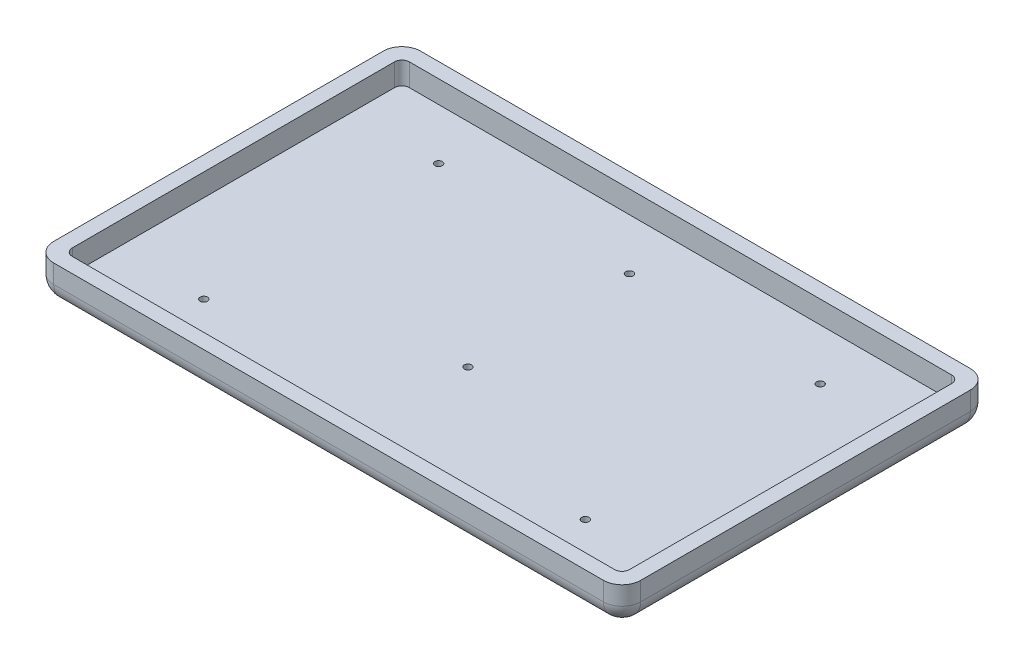
ISO-10303-21;
HEADER;
FILE_DESCRIPTION(('STEP AP214'),'2;1');
FILE_NAME('part.step','',(''),(''),'','','');
FILE_SCHEMA(('AUTOMOTIVE_DESIGN { 1 0 10303 214 1 1 1 1 }'));
ENDSEC;
DATA;
#1=APPLICATION_CONTEXT('core data for automotive mechanical design processes');
#2=APPLICATION_PROTOCOL_DEFINITION('international standard','automotive_design',2000,#1);
#3=PRODUCT_CONTEXT('',#1,'mechanical');
#4=PRODUCT('Part','Part','',(#3));
#5=PRODUCT_RELATED_PRODUCT_CATEGORY('part','',(#4));
#6=PRODUCT_DEFINITION_FORMATION('','',#4);
#7=PRODUCT_DEFINITION_CONTEXT('part definition',#1,'design');
#8=PRODUCT_DEFINITION('design','',#6,#7);
#9=PRODUCT_DEFINITION_SHAPE('','',#8);
#10=(LENGTH_UNIT() NAMED_UNIT(*) SI_UNIT(.MILLI.,.METRE.));
#11=(NAMED_UNIT(*) PLANE_ANGLE_UNIT() SI_UNIT($,.RADIAN.));
#12=(NAMED_UNIT(*) SI_UNIT($,.STERADIAN.) SOLID_ANGLE_UNIT());
#13=UNCERTAINTY_MEASURE_WITH_UNIT(LENGTH_MEASURE(1.E-05),#10,'distance_accuracy_value','');
#14=(GEOMETRIC_REPRESENTATION_CONTEXT(3) GLOBAL_UNCERTAINTY_ASSIGNED_CONTEXT((#13)) GLOBAL_UNIT_ASSIGNED_CONTEXT((#10,
#11,#12)) REPRESENTATION_CONTEXT('',''));
#15=CARTESIAN_POINT('',(0.,0.,0.));
#16=DIRECTION('',(0.,0.,1.));
#17=DIRECTION('',(1.,0.,0.));
#18=AXIS2_PLACEMENT_3D('',#15,#16,#17);
#19=CARTESIAN_POINT('',(-100.,12.7,-62.5));
#20=DIRECTION('',(1.,0.,0.));
#21=DIRECTION('',(0.,0.,-1.));
#22=AXIS2_PLACEMENT_3D('',#19,#20,#21);
#23=PLANE('',#22);
#24=DIRECTION('',(0.,-1.,0.));
#25=VECTOR('',#24,1.);
#26=CARTESIAN_POINT('',(-100.,12.7,-56.15));
#27=LINE('',#26,#25);
#28=CARTESIAN_POINT('',(-100.,12.7,-56.15));
#29=VERTEX_POINT('',#28);
#30=CARTESIAN_POINT('',(-100.,6.35,-56.15));
#31=VERTEX_POINT('',#30);
#32=EDGE_CURVE('E276',#29,#31,#27,.T.);
#33=ORIENTED_EDGE('',*,*,#32,.T.);
#34=DIRECTION('',(0.,0.,1.));
#35=VECTOR('',#34,1.);
#36=CARTESIAN_POINT('',(-100.,6.35,-62.5));
#37=LINE('',#36,#35);
#38=CARTESIAN_POINT('',(-100.,6.35,56.15));
#39=VERTEX_POINT('',#38);
#40=EDGE_CURVE('E322',#31,#39,#37,.T.);
#41=ORIENTED_EDGE('',*,*,#40,.T.);
#42=DIRECTION('',(0.,-1.,0.));
#43=VECTOR('',#42,1.);
#44=CARTESIAN_POINT('',(-100.,12.7,56.15));
#45=LINE('',#44,#43);
#46=CARTESIAN_POINT('',(-100.,12.7,56.15));
#47=VERTEX_POINT('',#46);
#48=EDGE_CURVE('E280',#39,#47,#45,.F.);
#49=ORIENTED_EDGE('',*,*,#48,.T.);
#50=DIRECTION('',(0.,0.,1.));
#51=VECTOR('',#50,1.);
#52=CARTESIAN_POINT('',(-100.,12.7,-62.5));
#53=LINE('',#52,#51);
#54=EDGE_CURVE('E213',#29,#47,#53,.T.);
#55=ORIENTED_EDGE('',*,*,#54,.F.);
#56=EDGE_LOOP('',(#33,#41,#49,#55));
#57=FACE_BOUND('',#56,.T.);
#58=ADVANCED_FACE('F45',(#57),#23,.F.);
#59=CARTESIAN_POINT('',(-100.,12.7,62.5));
#60=DIRECTION('',(0.,0.,-1.));
#61=DIRECTION('',(-1.,0.,0.));
#62=AXIS2_PLACEMENT_3D('',#59,#60,#61);
#63=PLANE('',#62);
#64=DIRECTION('',(0.,-1.,0.));
#65=VECTOR('',#64,1.);
#66=CARTESIAN_POINT('',(-93.65,12.7,62.5));
#67=LINE('',#66,#65);
#68=CARTESIAN_POINT('',(-93.65,12.7,62.5));
#69=VERTEX_POINT('',#68);
#70=CARTESIAN_POINT('',(-93.65,6.35,62.5));
#71=VERTEX_POINT('',#70);
#72=EDGE_CURVE('E272',#69,#71,#67,.T.);
#73=ORIENTED_EDGE('',*,*,#72,.T.);
#74=DIRECTION('',(1.,0.,0.));
#75=VECTOR('',#74,1.);
#76=CARTESIAN_POINT('',(-100.,6.35,62.5));
#77=LINE('',#76,#75);
#78=CARTESIAN_POINT('',(93.65,6.35,62.5));
#79=VERTEX_POINT('',#78);
#80=EDGE_CURVE('E335',#71,#79,#77,.T.);
#81=ORIENTED_EDGE('',*,*,#80,.T.);
#82=DIRECTION('',(0.,-1.,0.));
#83=VECTOR('',#82,1.);
#84=CARTESIAN_POINT('',(93.65,12.7,62.5));
#85=LINE('',#84,#83);
#86=CARTESIAN_POINT('',(93.65,12.7,62.5));
#87=VERTEX_POINT('',#86);
#88=EDGE_CURVE('E269',#79,#87,#85,.F.);
#89=ORIENTED_EDGE('',*,*,#88,.T.);
#90=DIRECTION('',(1.,0.,0.));
#91=VECTOR('',#90,1.);
#92=CARTESIAN_POINT('',(-100.,12.7,62.5));
#93=LINE('',#92,#91);
#94=EDGE_CURVE('E217',#69,#87,#93,.T.);
#95=ORIENTED_EDGE('',*,*,#94,.F.);
#96=EDGE_LOOP('',(#73,#81,#89,#95));
#97=FACE_BOUND('',#96,.T.);
#98=ADVANCED_FACE('F487',(#97),#63,.F.);
#99=CARTESIAN_POINT('',(100.,12.7,-62.5));
#100=DIRECTION('',(-1.,0.,0.));
#101=DIRECTION('',(0.,0.,1.));
#102=AXIS2_PLACEMENT_3D('',#99,#100,#101);
#103=PLANE('',#102);
#104=DIRECTION('',(0.,-1.,0.));
#105=VECTOR('',#104,1.);
#106=CARTESIAN_POINT('',(100.,12.7,56.15));
#107=LINE('',#106,#105);
#108=CARTESIAN_POINT('',(100.,12.7,56.15));
#109=VERTEX_POINT('',#108);
#110=CARTESIAN_POINT('',(100.,6.35,56.15));
#111=VERTEX_POINT('',#110);
#112=EDGE_CURVE('E302',#109,#111,#107,.T.);
#113=ORIENTED_EDGE('',*,*,#112,.T.);
#114=DIRECTION('',(0.,0.,-1.));
#115=VECTOR('',#114,1.);
#116=CARTESIAN_POINT('',(100.,6.35,-62.5));
#117=LINE('',#116,#115);
#118=CARTESIAN_POINT('',(100.,6.35,-56.15));
#119=VERTEX_POINT('',#118);
#120=EDGE_CURVE('E55',#111,#119,#117,.T.);
#121=ORIENTED_EDGE('',*,*,#120,.T.);
#122=DIRECTION('',(0.,-1.,0.));
#123=VECTOR('',#122,1.);
#124=CARTESIAN_POINT('',(100.,12.7,-56.15));
#125=LINE('',#124,#123);
#126=CARTESIAN_POINT('',(100.,12.7,-56.15));
#127=VERTEX_POINT('',#126);
#128=EDGE_CURVE('E306',#119,#127,#125,.F.);
#129=ORIENTED_EDGE('',*,*,#128,.T.);
#130=DIRECTION('',(0.,0.,-1.));
#131=VECTOR('',#130,1.);
#132=CARTESIAN_POINT('',(100.,12.7,-62.5));
#133=LINE('',#132,#131);
#134=EDGE_CURVE('E221',#109,#127,#133,.T.);
#135=ORIENTED_EDGE('',*,*,#134,.F.);
#136=EDGE_LOOP('',(#113,#121,#129,#135));
#137=FACE_BOUND('',#136,.T.);
#138=ADVANCED_FACE('F493',(#137),#103,.F.);
#139=CARTESIAN_POINT('',(-100.,12.7,-62.5));
#140=DIRECTION('',(0.,0.,1.));
#141=DIRECTION('',(1.,0.,0.));
#142=AXIS2_PLACEMENT_3D('',#139,#140,#141);
#143=PLANE('',#142);
#144=DIRECTION('',(0.,-1.,0.));
#145=VECTOR('',#144,1.);
#146=CARTESIAN_POINT('',(93.65,12.7,-62.5));
#147=LINE('',#146,#145);
#148=CARTESIAN_POINT('',(93.65,12.7,-62.5));
#149=VERTEX_POINT('',#148);
#150=CARTESIAN_POINT('',(93.65,6.35,-62.5));
#151=VERTEX_POINT('',#150);
#152=EDGE_CURVE('E295',#149,#151,#147,.T.);
#153=ORIENTED_EDGE('',*,*,#152,.T.);
#154=DIRECTION('',(-1.,0.,0.));
#155=VECTOR('',#154,1.);
#156=CARTESIAN_POINT('',(-100.,6.35,-62.5));
#157=LINE('',#156,#155);
#158=CARTESIAN_POINT('',(-93.65,6.35,-62.5));
#159=VERTEX_POINT('',#158);
#160=EDGE_CURVE('E11',#151,#159,#157,.T.);
#161=ORIENTED_EDGE('',*,*,#160,.T.);
#162=DIRECTION('',(0.,-1.,0.));
#163=VECTOR('',#162,1.);
#164=CARTESIAN_POINT('',(-93.65,12.7,-62.5));
#165=LINE('',#164,#163);
#166=CARTESIAN_POINT('',(-93.65,12.7,-62.5));
#167=VERTEX_POINT('',#166);
#168=EDGE_CURVE('E299',#159,#167,#165,.F.);
#169=ORIENTED_EDGE('',*,*,#168,.T.);
#170=DIRECTION('',(-1.,0.,0.));
#171=VECTOR('',#170,1.);
#172=CARTESIAN_POINT('',(-100.,12.7,-62.5));
#173=LINE('',#172,#171);
#174=EDGE_CURVE('E225',#149,#167,#173,.T.);
#175=ORIENTED_EDGE('',*,*,#174,.F.);
#176=EDGE_LOOP('',(#153,#161,#169,#175));
#177=FACE_BOUND('',#176,.T.);
#178=ADVANCED_FACE('F499',(#177),#143,.F.);
#179=CARTESIAN_POINT('',(0.,12.7,0.));
#180=DIRECTION('',(0.,1.,0.));
#181=DIRECTION('',(0.,0.,1.));
#182=AXIS2_PLACEMENT_3D('',#179,#180,#181);
#183=PLANE('',#182);
#184=DIRECTION('',(0.,0.,-1.));
#185=VECTOR('',#184,1.);
#186=CARTESIAN_POINT('',(94.92,12.7,-57.42));
#187=LINE('',#186,#185);
#188=CARTESIAN_POINT('',(94.92,12.7,54.88));
#189=VERTEX_POINT('',#188);
#190=CARTESIAN_POINT('',(94.92,12.7,-54.88));
#191=VERTEX_POINT('',#190);
#192=EDGE_CURVE('E371',#189,#191,#187,.T.);
#193=ORIENTED_EDGE('',*,*,#192,.F.);
#194=CARTESIAN_POINT('',(92.38,12.7,54.88));
#195=DIRECTION('',(0.,1.,0.));
#196=DIRECTION('',(0.,0.,1.));
#197=AXIS2_PLACEMENT_3D('',#194,#195,#196);
#198=CIRCLE('',#197,2.54);
#199=CARTESIAN_POINT('',(92.38,12.7,57.42));
#200=VERTEX_POINT('',#199);
#201=EDGE_CURVE('E182',#189,#200,#198,.F.);
#202=ORIENTED_EDGE('',*,*,#201,.T.);
#203=DIRECTION('',(1.,0.,0.));
#204=VECTOR('',#203,1.);
#205=CARTESIAN_POINT('',(-94.92,12.7,57.42));
#206=LINE('',#205,#204);
#207=CARTESIAN_POINT('',(-92.38,12.7,57.42));
#208=VERTEX_POINT('',#207);
#209=EDGE_CURVE('E189',#208,#200,#206,.T.);
#210=ORIENTED_EDGE('',*,*,#209,.F.);
#211=CARTESIAN_POINT('',(-92.38,12.7,54.88));
#212=DIRECTION('',(0.,1.,0.));
#213=DIRECTION('',(0.,0.,1.));
#214=AXIS2_PLACEMENT_3D('',#211,#212,#213);
#215=CIRCLE('',#214,2.54);
#216=CARTESIAN_POINT('',(-94.92,12.7,54.88));
#217=VERTEX_POINT('',#216);
#218=EDGE_CURVE('E171',#208,#217,#215,.F.);
#219=ORIENTED_EDGE('',*,*,#218,.T.);
#220=DIRECTION('',(0.,0.,1.));
#221=VECTOR('',#220,1.);
#222=CARTESIAN_POINT('',(-94.92,12.7,-57.42));
#223=LINE('',#222,#221);
#224=CARTESIAN_POINT('',(-94.92,12.7,-54.88));
#225=VERTEX_POINT('',#224);
#226=EDGE_CURVE('E202',#225,#217,#223,.T.);
#227=ORIENTED_EDGE('',*,*,#226,.F.);
#228=CARTESIAN_POINT('',(-92.38,12.7,-54.88));
#229=DIRECTION('',(0.,1.,0.));
#230=DIRECTION('',(0.,0.,1.));
#231=AXIS2_PLACEMENT_3D('',#228,#229,#230);
#232=CIRCLE('',#231,2.54);
#233=CARTESIAN_POINT('',(-92.38,12.7,-57.42));
#234=VERTEX_POINT('',#233);
#235=EDGE_CURVE('E266',#225,#234,#232,.F.);
#236=ORIENTED_EDGE('',*,*,#235,.T.);
#237=DIRECTION('',(-1.,0.,0.));
#238=VECTOR('',#237,1.);
#239=CARTESIAN_POINT('',(-94.92,12.7,-57.42));
#240=LINE('',#239,#238);
#241=CARTESIAN_POINT('',(92.38,12.7,-57.42));
#242=VERTEX_POINT('',#241);
#243=EDGE_CURVE('E209',#242,#234,#240,.T.);
#244=ORIENTED_EDGE('',*,*,#243,.F.);
#245=CARTESIAN_POINT('',(92.38,12.7,-54.88));
#246=DIRECTION('',(0.,1.,0.));
#247=DIRECTION('',(0.,0.,1.));
#248=AXIS2_PLACEMENT_3D('',#245,#246,#247);
#249=CIRCLE('',#248,2.54);
#250=EDGE_CURVE('E263',#242,#191,#249,.F.);
#251=ORIENTED_EDGE('',*,*,#250,.T.);
#252=EDGE_LOOP('',(#193,#202,#210,#219,#227,#236,#244,#251));
#253=FACE_BOUND('',#252,.T.);
#254=ORIENTED_EDGE('',*,*,#54,.T.);
#255=CARTESIAN_POINT('',(-93.65,12.7,56.15));
#256=DIRECTION('',(0.,1.,0.));
#257=DIRECTION('',(0.,0.,1.));
#258=AXIS2_PLACEMENT_3D('',#255,#256,#257);
#259=CIRCLE('',#258,6.35);
#260=EDGE_CURVE('E292',#47,#69,#259,.T.);
#261=ORIENTED_EDGE('',*,*,#260,.T.);
#262=ORIENTED_EDGE('',*,*,#94,.T.);
#263=CARTESIAN_POINT('',(93.65,12.7,56.15));
#264=DIRECTION('',(0.,1.,0.));
#265=DIRECTION('',(0.,0.,1.));
#266=AXIS2_PLACEMENT_3D('',#263,#264,#265);
#267=CIRCLE('',#266,6.35);
#268=EDGE_CURVE('E283',#87,#109,#267,.T.);
#269=ORIENTED_EDGE('',*,*,#268,.T.);
#270=ORIENTED_EDGE('',*,*,#134,.T.);
#271=CARTESIAN_POINT('',(93.65,12.7,-56.15));
#272=DIRECTION('',(0.,1.,0.));
#273=DIRECTION('',(0.,0.,1.));
#274=AXIS2_PLACEMENT_3D('',#271,#272,#273);
#275=CIRCLE('',#274,6.35);
#276=EDGE_CURVE('E286',#127,#149,#275,.T.);
#277=ORIENTED_EDGE('',*,*,#276,.T.);
#278=ORIENTED_EDGE('',*,*,#174,.T.);
#279=CARTESIAN_POINT('',(-93.65,12.7,-56.15));
#280=DIRECTION('',(0.,1.,0.));
#281=DIRECTION('',(0.,0.,1.));
#282=AXIS2_PLACEMENT_3D('',#279,#280,#281);
#283=CIRCLE('',#282,6.35);
#284=EDGE_CURVE('E289',#167,#29,#283,.T.);
#285=ORIENTED_EDGE('',*,*,#284,.T.);
#286=EDGE_LOOP('',(#254,#261,#262,#269,#270,#277,#278,#285));
#287=FACE_BOUND('',#286,.T.);
#288=ADVANCED_FACE('F198',(#253,#287),#183,.T.);
#289=CARTESIAN_POINT('',(0.,0.,0.));
#290=DIRECTION('',(0.,1.,0.));
#291=DIRECTION('',(0.,0.,1.));
#292=AXIS2_PLACEMENT_3D('',#289,#290,#291);
#293=PLANE('',#292);
#294=CARTESIAN_POINT('',(-65.,0.,-40.));
#295=DIRECTION('',(0.,1.,0.));
#296=DIRECTION('',(0.,0.,1.));
#297=AXIS2_PLACEMENT_3D('',#294,#295,#296);
#298=CIRCLE('',#297,1.25);
#299=CARTESIAN_POINT('',(-65.,0.,-38.75));
#300=VERTEX_POINT('',#299);
#301=EDGE_CURVE('E431',#300,#300,#298,.T.);
#302=ORIENTED_EDGE('',*,*,#301,.T.);
#303=EDGE_LOOP('',(#302));
#304=FACE_BOUND('',#303,.T.);
#305=CARTESIAN_POINT('',(65.,0.,-40.));
#306=DIRECTION('',(0.,1.,0.));
#307=DIRECTION('',(0.,0.,1.));
#308=AXIS2_PLACEMENT_3D('',#305,#306,#307);
#309=CIRCLE('',#308,1.25);
#310=CARTESIAN_POINT('',(65.,0.,-38.75));
#311=VERTEX_POINT('',#310);
#312=EDGE_CURVE('E423',#311,#311,#309,.T.);
#313=ORIENTED_EDGE('',*,*,#312,.T.);
#314=EDGE_LOOP('',(#313));
#315=FACE_BOUND('',#314,.T.);
#316=CARTESIAN_POINT('',(65.,0.,40.));
#317=DIRECTION('',(0.,1.,0.));
#318=DIRECTION('',(0.,0.,1.));
#319=AXIS2_PLACEMENT_3D('',#316,#317,#318);
#320=CIRCLE('',#319,1.25);
#321=CARTESIAN_POINT('',(65.,0.,41.25));
#322=VERTEX_POINT('',#321);
#323=EDGE_CURVE('E415',#322,#322,#320,.T.);
#324=ORIENTED_EDGE('',*,*,#323,.T.);
#325=EDGE_LOOP('',(#324));
#326=FACE_BOUND('',#325,.T.);
#327=CARTESIAN_POINT('',(-65.,0.,40.));
#328=DIRECTION('',(0.,1.,0.));
#329=DIRECTION('',(0.,0.,1.));
#330=AXIS2_PLACEMENT_3D('',#327,#328,#329);
#331=CIRCLE('',#330,1.25);
#332=CARTESIAN_POINT('',(-65.,0.,41.25));
#333=VERTEX_POINT('',#332);
#334=EDGE_CURVE('E407',#333,#333,#331,.T.);
#335=ORIENTED_EDGE('',*,*,#334,.T.);
#336=EDGE_LOOP('',(#335));
#337=FACE_BOUND('',#336,.T.);
#338=CARTESIAN_POINT('',(0.,0.,-40.));
#339=DIRECTION('',(0.,1.,0.));
#340=DIRECTION('',(0.,0.,1.));
#341=AXIS2_PLACEMENT_3D('',#338,#339,#340);
#342=CIRCLE('',#341,1.25);
#343=CARTESIAN_POINT('',(0.,0.,-38.75));
#344=VERTEX_POINT('',#343);
#345=EDGE_CURVE('E399',#344,#344,#342,.T.);
#346=ORIENTED_EDGE('',*,*,#345,.T.);
#347=EDGE_LOOP('',(#346));
#348=FACE_BOUND('',#347,.T.);
#349=CARTESIAN_POINT('',(0.,0.,15.));
#350=DIRECTION('',(0.,1.,0.));
#351=DIRECTION('',(0.,0.,1.));
#352=AXIS2_PLACEMENT_3D('',#349,#350,#351);
#353=CIRCLE('',#352,1.25);
#354=CARTESIAN_POINT('',(0.,0.,16.25));
#355=VERTEX_POINT('',#354);
#356=EDGE_CURVE('E345',#355,#355,#353,.T.);
#357=ORIENTED_EDGE('',*,*,#356,.T.);
#358=EDGE_LOOP('',(#357));
#359=FACE_BOUND('',#358,.T.);
#360=DIRECTION('',(1.,0.,0.));
#361=VECTOR('',#360,1.);
#362=CARTESIAN_POINT('',(0.,0.,56.15));
#363=LINE('',#362,#361);
#364=CARTESIAN_POINT('',(93.65,0.,56.15));
#365=VERTEX_POINT('',#364);
#366=CARTESIAN_POINT('',(-93.65,0.,56.15));
#367=VERTEX_POINT('',#366);
#368=EDGE_CURVE('E63',#365,#367,#363,.F.);
#369=ORIENTED_EDGE('',*,*,#368,.T.);
#370=DIRECTION('',(0.,0.,1.));
#371=VECTOR('',#370,1.);
#372=CARTESIAN_POINT('',(-93.65,0.,0.));
#373=LINE('',#372,#371);
#374=CARTESIAN_POINT('',(-93.65,0.,-56.15));
#375=VERTEX_POINT('',#374);
#376=EDGE_CURVE('E332',#367,#375,#373,.F.);
#377=ORIENTED_EDGE('',*,*,#376,.T.);
#378=DIRECTION('',(-1.,0.,0.));
#379=VECTOR('',#378,1.);
#380=CARTESIAN_POINT('',(0.,0.,-56.15));
#381=LINE('',#380,#379);
#382=CARTESIAN_POINT('',(93.65,0.,-56.15));
#383=VERTEX_POINT('',#382);
#384=EDGE_CURVE('E325',#375,#383,#381,.F.);
#385=ORIENTED_EDGE('',*,*,#384,.T.);
#386=DIRECTION('',(0.,0.,-1.));
#387=VECTOR('',#386,1.);
#388=CARTESIAN_POINT('',(93.65,0.,0.));
#389=LINE('',#388,#387);
#390=EDGE_CURVE('E68',#383,#365,#389,.F.);
#391=ORIENTED_EDGE('',*,*,#390,.T.);
#392=EDGE_LOOP('',(#369,#377,#385,#391));
#393=FACE_BOUND('',#392,.T.);
#394=ADVANCED_FACE('F504',(#304,#315,#326,#337,#348,#359,#393),#293,.F.);
#395=CARTESIAN_POINT('',(94.92,5.08,-57.42));
#396=DIRECTION('',(1.,0.,0.));
#397=DIRECTION('',(0.,0.,-1.));
#398=AXIS2_PLACEMENT_3D('',#395,#396,#397);
#399=PLANE('',#398);
#400=DIRECTION('',(0.,0.,-1.));
#401=VECTOR('',#400,1.);
#402=CARTESIAN_POINT('',(94.92,5.08,-57.42));
#403=LINE('',#402,#401);
#404=CARTESIAN_POINT('',(94.92,5.08,54.88));
#405=VERTEX_POINT('',#404);
#406=CARTESIAN_POINT('',(94.92,5.08,-54.88));
#407=VERTEX_POINT('',#406);
#408=EDGE_CURVE('E201',#405,#407,#403,.T.);
#409=ORIENTED_EDGE('',*,*,#408,.F.);
#410=DIRECTION('',(0.,1.,0.));
#411=VECTOR('',#410,1.);
#412=CARTESIAN_POINT('',(94.92,12.7,54.88));
#413=LINE('',#412,#411);
#414=EDGE_CURVE('E251',#405,#189,#413,.T.);
#415=ORIENTED_EDGE('',*,*,#414,.T.);
#416=ORIENTED_EDGE('',*,*,#192,.T.);
#417=DIRECTION('',(0.,1.,0.));
#418=VECTOR('',#417,1.);
#419=CARTESIAN_POINT('',(94.92,5.08,-54.88));
#420=LINE('',#419,#418);
#421=EDGE_CURVE('E248',#191,#407,#420,.F.);
#422=ORIENTED_EDGE('',*,*,#421,.T.);
#423=EDGE_LOOP('',(#409,#415,#416,#422));
#424=FACE_BOUND('',#423,.T.);
#425=ADVANCED_FACE('F473',(#424),#399,.F.);
#426=CARTESIAN_POINT('',(-94.92,5.08,57.42));
#427=DIRECTION('',(0.,0.,1.));
#428=DIRECTION('',(1.,0.,0.));
#429=AXIS2_PLACEMENT_3D('',#426,#427,#428);
#430=PLANE('',#429);
#431=DIRECTION('',(1.,0.,0.));
#432=VECTOR('',#431,1.);
#433=CARTESIAN_POINT('',(-94.92,5.08,57.42));
#434=LINE('',#433,#432);
#435=CARTESIAN_POINT('',(-92.38,5.08,57.42));
#436=VERTEX_POINT('',#435);
#437=CARTESIAN_POINT('',(92.38,5.08,57.42));
#438=VERTEX_POINT('',#437);
#439=EDGE_CURVE('E192',#436,#438,#434,.T.);
#440=ORIENTED_EDGE('',*,*,#439,.F.);
#441=DIRECTION('',(0.,1.,0.));
#442=VECTOR('',#441,1.);
#443=CARTESIAN_POINT('',(-92.38,12.7,57.42));
#444=LINE('',#443,#442);
#445=EDGE_CURVE('E175',#436,#208,#444,.T.);
#446=ORIENTED_EDGE('',*,*,#445,.T.);
#447=ORIENTED_EDGE('',*,*,#209,.T.);
#448=DIRECTION('',(0.,1.,0.));
#449=VECTOR('',#448,1.);
#450=CARTESIAN_POINT('',(92.38,5.08,57.42));
#451=LINE('',#450,#449);
#452=EDGE_CURVE('E195',#200,#438,#451,.F.);
#453=ORIENTED_EDGE('',*,*,#452,.T.);
#454=EDGE_LOOP('',(#440,#446,#447,#453));
#455=FACE_BOUND('',#454,.T.);
#456=ADVANCED_FACE('F188',(#455),#430,.F.);
#457=CARTESIAN_POINT('',(-94.92,5.08,-57.42));
#458=DIRECTION('',(-1.,0.,0.));
#459=DIRECTION('',(0.,0.,1.));
#460=AXIS2_PLACEMENT_3D('',#457,#458,#459);
#461=PLANE('',#460);
#462=ORIENTED_EDGE('',*,*,#226,.T.);
#463=DIRECTION('',(0.,1.,0.));
#464=VECTOR('',#463,1.);
#465=CARTESIAN_POINT('',(-94.92,5.08,54.88));
#466=LINE('',#465,#464);
#467=CARTESIAN_POINT('',(-94.92,5.08,54.88));
#468=VERTEX_POINT('',#467);
#469=EDGE_CURVE('E176',#217,#468,#466,.F.);
#470=ORIENTED_EDGE('',*,*,#469,.T.);
#471=DIRECTION('',(0.,0.,1.));
#472=VECTOR('',#471,1.);
#473=CARTESIAN_POINT('',(-94.92,5.08,-57.42));
#474=LINE('',#473,#472);
#475=CARTESIAN_POINT('',(-94.92,5.08,-54.88));
#476=VERTEX_POINT('',#475);
#477=EDGE_CURVE('E385',#476,#468,#474,.T.);
#478=ORIENTED_EDGE('',*,*,#477,.F.);
#479=DIRECTION('',(0.,1.,0.));
#480=VECTOR('',#479,1.);
#481=CARTESIAN_POINT('',(-94.92,12.7,-54.88));
#482=LINE('',#481,#480);
#483=EDGE_CURVE('E194',#476,#225,#482,.T.);
#484=ORIENTED_EDGE('',*,*,#483,.T.);
#485=EDGE_LOOP('',(#462,#470,#478,#484));
#486=FACE_BOUND('',#485,.T.);
#487=ADVANCED_FACE('F461',(#486),#461,.F.);
#488=CARTESIAN_POINT('',(-94.92,5.08,-57.42));
#489=DIRECTION('',(0.,0.,-1.));
#490=DIRECTION('',(-1.,0.,0.));
#491=AXIS2_PLACEMENT_3D('',#488,#489,#490);
#492=PLANE('',#491);
#493=DIRECTION('',(-1.,0.,0.));
#494=VECTOR('',#493,1.);
#495=CARTESIAN_POINT('',(-94.92,5.08,-57.42));
#496=LINE('',#495,#494);
#497=CARTESIAN_POINT('',(92.38,5.08,-57.42));
#498=VERTEX_POINT('',#497);
#499=CARTESIAN_POINT('',(-92.38,5.08,-57.42));
#500=VERTEX_POINT('',#499);
#501=EDGE_CURVE('E207',#498,#500,#496,.T.);
#502=ORIENTED_EDGE('',*,*,#501,.F.);
#503=DIRECTION('',(0.,1.,0.));
#504=VECTOR('',#503,1.);
#505=CARTESIAN_POINT('',(92.38,12.7,-57.42));
#506=LINE('',#505,#504);
#507=EDGE_CURVE('E183',#498,#242,#506,.T.);
#508=ORIENTED_EDGE('',*,*,#507,.T.);
#509=ORIENTED_EDGE('',*,*,#243,.T.);
#510=DIRECTION('',(0.,1.,0.));
#511=VECTOR('',#510,1.);
#512=CARTESIAN_POINT('',(-92.38,5.08,-57.42));
#513=LINE('',#512,#511);
#514=EDGE_CURVE('E255',#234,#500,#513,.F.);
#515=ORIENTED_EDGE('',*,*,#514,.T.);
#516=EDGE_LOOP('',(#502,#508,#509,#515));
#517=FACE_BOUND('',#516,.T.);
#518=ADVANCED_FACE('F445',(#517),#492,.F.);
#519=CARTESIAN_POINT('',(0.,5.08,0.));
#520=DIRECTION('',(0.,1.,0.));
#521=DIRECTION('',(0.,0.,1.));
#522=AXIS2_PLACEMENT_3D('',#519,#520,#521);
#523=PLANE('',#522);
#524=CARTESIAN_POINT('',(-65.,5.08,-40.));
#525=DIRECTION('',(0.,1.,0.));
#526=DIRECTION('',(0.,0.,1.));
#527=AXIS2_PLACEMENT_3D('',#524,#525,#526);
#528=CIRCLE('',#527,1.25);
#529=CARTESIAN_POINT('',(-65.,5.08,-38.75));
#530=VERTEX_POINT('',#529);
#531=EDGE_CURVE('E435',#530,#530,#528,.T.);
#532=ORIENTED_EDGE('',*,*,#531,.F.);
#533=EDGE_LOOP('',(#532));
#534=FACE_BOUND('',#533,.T.);
#535=CARTESIAN_POINT('',(65.,5.08,-40.));
#536=DIRECTION('',(0.,1.,0.));
#537=DIRECTION('',(0.,0.,1.));
#538=AXIS2_PLACEMENT_3D('',#535,#536,#537);
#539=CIRCLE('',#538,1.25);
#540=CARTESIAN_POINT('',(65.,5.08,-38.75));
#541=VERTEX_POINT('',#540);
#542=EDGE_CURVE('E427',#541,#541,#539,.T.);
#543=ORIENTED_EDGE('',*,*,#542,.F.);
#544=EDGE_LOOP('',(#543));
#545=FACE_BOUND('',#544,.T.);
#546=CARTESIAN_POINT('',(65.,5.08,40.));
#547=DIRECTION('',(0.,1.,0.));
#548=DIRECTION('',(0.,0.,1.));
#549=AXIS2_PLACEMENT_3D('',#546,#547,#548);
#550=CIRCLE('',#549,1.25);
#551=CARTESIAN_POINT('',(65.,5.08,41.25));
#552=VERTEX_POINT('',#551);
#553=EDGE_CURVE('E419',#552,#552,#550,.T.);
#554=ORIENTED_EDGE('',*,*,#553,.F.);
#555=EDGE_LOOP('',(#554));
#556=FACE_BOUND('',#555,.T.);
#557=CARTESIAN_POINT('',(-65.,5.08,40.));
#558=DIRECTION('',(0.,1.,0.));
#559=DIRECTION('',(0.,0.,1.));
#560=AXIS2_PLACEMENT_3D('',#557,#558,#559);
#561=CIRCLE('',#560,1.25);
#562=CARTESIAN_POINT('',(-65.,5.08,41.25));
#563=VERTEX_POINT('',#562);
#564=EDGE_CURVE('E411',#563,#563,#561,.T.);
#565=ORIENTED_EDGE('',*,*,#564,.F.);
#566=EDGE_LOOP('',(#565));
#567=FACE_BOUND('',#566,.T.);
#568=CARTESIAN_POINT('',(0.,5.08,-40.));
#569=DIRECTION('',(0.,1.,0.));
#570=DIRECTION('',(0.,0.,1.));
#571=AXIS2_PLACEMENT_3D('',#568,#569,#570);
#572=CIRCLE('',#571,1.25);
#573=CARTESIAN_POINT('',(0.,5.08,-38.75));
#574=VERTEX_POINT('',#573);
#575=EDGE_CURVE('E403',#574,#574,#572,.T.);
#576=ORIENTED_EDGE('',*,*,#575,.F.);
#577=EDGE_LOOP('',(#576));
#578=FACE_BOUND('',#577,.T.);
#579=CARTESIAN_POINT('',(0.,5.08,15.));
#580=DIRECTION('',(0.,1.,0.));
#581=DIRECTION('',(0.,0.,1.));
#582=AXIS2_PLACEMENT_3D('',#579,#580,#581);
#583=CIRCLE('',#582,1.25);
#584=CARTESIAN_POINT('',(0.,5.08,16.25));
#585=VERTEX_POINT('',#584);
#586=EDGE_CURVE('E395',#585,#585,#583,.T.);
#587=ORIENTED_EDGE('',*,*,#586,.F.);
#588=EDGE_LOOP('',(#587));
#589=FACE_BOUND('',#588,.T.);
#590=ORIENTED_EDGE('',*,*,#477,.T.);
#591=CARTESIAN_POINT('',(-92.38,5.08,54.88));
#592=DIRECTION('',(0.,1.,0.));
#593=DIRECTION('',(0.,0.,1.));
#594=AXIS2_PLACEMENT_3D('',#591,#592,#593);
#595=CIRCLE('',#594,2.54);
#596=EDGE_CURVE('E245',#468,#436,#595,.T.);
#597=ORIENTED_EDGE('',*,*,#596,.T.);
#598=ORIENTED_EDGE('',*,*,#439,.T.);
#599=CARTESIAN_POINT('',(92.38,5.08,54.88));
#600=DIRECTION('',(0.,1.,0.));
#601=DIRECTION('',(0.,0.,1.));
#602=AXIS2_PLACEMENT_3D('',#599,#600,#601);
#603=CIRCLE('',#602,2.54);
#604=EDGE_CURVE('E242',#438,#405,#603,.T.);
#605=ORIENTED_EDGE('',*,*,#604,.T.);
#606=ORIENTED_EDGE('',*,*,#408,.T.);
#607=CARTESIAN_POINT('',(92.38,5.08,-54.88));
#608=DIRECTION('',(0.,1.,0.));
#609=DIRECTION('',(0.,0.,1.));
#610=AXIS2_PLACEMENT_3D('',#607,#608,#609);
#611=CIRCLE('',#610,2.54);
#612=EDGE_CURVE('E239',#407,#498,#611,.T.);
#613=ORIENTED_EDGE('',*,*,#612,.T.);
#614=ORIENTED_EDGE('',*,*,#501,.T.);
#615=CARTESIAN_POINT('',(-92.38,5.08,-54.88));
#616=DIRECTION('',(0.,1.,0.));
#617=DIRECTION('',(0.,0.,1.));
#618=AXIS2_PLACEMENT_3D('',#615,#616,#617);
#619=CIRCLE('',#618,2.54);
#620=EDGE_CURVE('E236',#500,#476,#619,.T.);
#621=ORIENTED_EDGE('',*,*,#620,.T.);
#622=EDGE_LOOP('',(#590,#597,#598,#605,#606,#613,#614,#621));
#623=FACE_BOUND('',#622,.T.);
#624=ADVANCED_FACE('F442',(#534,#545,#556,#567,#578,#589,#623),#523,.T.);
#625=CARTESIAN_POINT('',(-92.38,5.08,54.88));
#626=DIRECTION('',(0.,-1.,0.));
#627=DIRECTION('',(0.,0.,-1.));
#628=AXIS2_PLACEMENT_3D('',#625,#626,#627);
#629=CYLINDRICAL_SURFACE('',#628,2.54);
#630=ORIENTED_EDGE('',*,*,#596,.F.);
#631=ORIENTED_EDGE('',*,*,#469,.F.);
#632=ORIENTED_EDGE('',*,*,#218,.F.);
#633=ORIENTED_EDGE('',*,*,#445,.F.);
#634=EDGE_LOOP('',(#630,#631,#632,#633));
#635=FACE_BOUND('',#634,.T.);
#636=ADVANCED_FACE('F174',(#635),#629,.F.);
#637=CARTESIAN_POINT('',(92.38,5.08,54.88));
#638=DIRECTION('',(0.,-1.,0.));
#639=DIRECTION('',(0.,0.,-1.));
#640=AXIS2_PLACEMENT_3D('',#637,#638,#639);
#641=CYLINDRICAL_SURFACE('',#640,2.54);
#642=ORIENTED_EDGE('',*,*,#604,.F.);
#643=ORIENTED_EDGE('',*,*,#452,.F.);
#644=ORIENTED_EDGE('',*,*,#201,.F.);
#645=ORIENTED_EDGE('',*,*,#414,.F.);
#646=EDGE_LOOP('',(#642,#643,#644,#645));
#647=FACE_BOUND('',#646,.T.);
#648=ADVANCED_FACE('F477',(#647),#641,.F.);
#649=CARTESIAN_POINT('',(92.38,5.08,-54.88));
#650=DIRECTION('',(0.,-1.,0.));
#651=DIRECTION('',(0.,0.,-1.));
#652=AXIS2_PLACEMENT_3D('',#649,#650,#651);
#653=CYLINDRICAL_SURFACE('',#652,2.54);
#654=ORIENTED_EDGE('',*,*,#612,.F.);
#655=ORIENTED_EDGE('',*,*,#421,.F.);
#656=ORIENTED_EDGE('',*,*,#250,.F.);
#657=ORIENTED_EDGE('',*,*,#507,.F.);
#658=EDGE_LOOP('',(#654,#655,#656,#657));
#659=FACE_BOUND('',#658,.T.);
#660=ADVANCED_FACE('F471',(#659),#653,.F.);
#661=CARTESIAN_POINT('',(-92.38,5.08,-54.88));
#662=DIRECTION('',(0.,-1.,0.));
#663=DIRECTION('',(0.,0.,-1.));
#664=AXIS2_PLACEMENT_3D('',#661,#662,#663);
#665=CYLINDRICAL_SURFACE('',#664,2.54);
#666=ORIENTED_EDGE('',*,*,#620,.F.);
#667=ORIENTED_EDGE('',*,*,#514,.F.);
#668=ORIENTED_EDGE('',*,*,#235,.F.);
#669=ORIENTED_EDGE('',*,*,#483,.F.);
#670=EDGE_LOOP('',(#666,#667,#668,#669));
#671=FACE_BOUND('',#670,.T.);
#672=ADVANCED_FACE('F463',(#671),#665,.F.);
#673=CARTESIAN_POINT('',(-93.65,12.7,56.15));
#674=DIRECTION('',(0.,-1.,0.));
#675=DIRECTION('',(0.,0.,-1.));
#676=AXIS2_PLACEMENT_3D('',#673,#674,#675);
#677=CYLINDRICAL_SURFACE('',#676,6.35);
#678=ORIENTED_EDGE('',*,*,#48,.F.);
#679=CARTESIAN_POINT('',(-93.65,6.35,56.15));
#680=DIRECTION('',(0.,-1.,0.));
#681=DIRECTION('',(0.,0.,-1.));
#682=AXIS2_PLACEMENT_3D('',#679,#680,#681);
#683=CIRCLE('',#682,6.35);
#684=EDGE_CURVE('E316',#39,#71,#683,.F.);
#685=ORIENTED_EDGE('',*,*,#684,.T.);
#686=ORIENTED_EDGE('',*,*,#72,.F.);
#687=ORIENTED_EDGE('',*,*,#260,.F.);
#688=EDGE_LOOP('',(#678,#685,#686,#687));
#689=FACE_BOUND('',#688,.T.);
#690=ADVANCED_FACE('F667',(#689),#677,.T.);
#691=CARTESIAN_POINT('',(-93.65,12.7,-56.15));
#692=DIRECTION('',(0.,-1.,0.));
#693=DIRECTION('',(0.,0.,-1.));
#694=AXIS2_PLACEMENT_3D('',#691,#692,#693);
#695=CYLINDRICAL_SURFACE('',#694,6.35);
#696=ORIENTED_EDGE('',*,*,#168,.F.);
#697=CARTESIAN_POINT('',(-93.65,6.35,-56.15));
#698=DIRECTION('',(0.,-1.,0.));
#699=DIRECTION('',(0.,0.,-1.));
#700=AXIS2_PLACEMENT_3D('',#697,#698,#699);
#701=CIRCLE('',#700,6.35);
#702=EDGE_CURVE('E319',#159,#31,#701,.F.);
#703=ORIENTED_EDGE('',*,*,#702,.T.);
#704=ORIENTED_EDGE('',*,*,#32,.F.);
#705=ORIENTED_EDGE('',*,*,#284,.F.);
#706=EDGE_LOOP('',(#696,#703,#704,#705));
#707=FACE_BOUND('',#706,.T.);
#708=ADVANCED_FACE('F659',(#707),#695,.T.);
#709=CARTESIAN_POINT('',(93.65,12.7,-56.15));
#710=DIRECTION('',(0.,-1.,0.));
#711=DIRECTION('',(0.,0.,-1.));
#712=AXIS2_PLACEMENT_3D('',#709,#710,#711);
#713=CYLINDRICAL_SURFACE('',#712,6.35);
#714=ORIENTED_EDGE('',*,*,#128,.F.);
#715=CARTESIAN_POINT('',(93.65,6.35,-56.15));
#716=DIRECTION('',(0.,-1.,0.));
#717=DIRECTION('',(0.,0.,-1.));
#718=AXIS2_PLACEMENT_3D('',#715,#716,#717);
#719=CIRCLE('',#718,6.35);
#720=EDGE_CURVE('E309',#119,#151,#719,.F.);
#721=ORIENTED_EDGE('',*,*,#720,.T.);
#722=ORIENTED_EDGE('',*,*,#152,.F.);
#723=ORIENTED_EDGE('',*,*,#276,.F.);
#724=EDGE_LOOP('',(#714,#721,#722,#723));
#725=FACE_BOUND('',#724,.T.);
#726=ADVANCED_FACE('F651',(#725),#713,.T.);
#727=CARTESIAN_POINT('',(93.65,12.7,56.15));
#728=DIRECTION('',(0.,-1.,0.));
#729=DIRECTION('',(0.,0.,-1.));
#730=AXIS2_PLACEMENT_3D('',#727,#728,#729);
#731=CYLINDRICAL_SURFACE('',#730,6.35);
#732=ORIENTED_EDGE('',*,*,#88,.F.);
#733=CARTESIAN_POINT('',(93.65,6.35,56.15));
#734=DIRECTION('',(0.,-1.,0.));
#735=DIRECTION('',(0.,0.,-1.));
#736=AXIS2_PLACEMENT_3D('',#733,#734,#735);
#737=CIRCLE('',#736,6.35);
#738=EDGE_CURVE('E313',#79,#111,#737,.F.);
#739=ORIENTED_EDGE('',*,*,#738,.T.);
#740=ORIENTED_EDGE('',*,*,#112,.F.);
#741=ORIENTED_EDGE('',*,*,#268,.F.);
#742=EDGE_LOOP('',(#732,#739,#740,#741));
#743=FACE_BOUND('',#742,.T.);
#744=ADVANCED_FACE('F644',(#743),#731,.T.);
#745=CARTESIAN_POINT('',(-93.65,6.35,56.15));
#746=DIRECTION('',(0.,1.,0.));
#747=DIRECTION('',(0.,0.,1.));
#748=AXIS2_PLACEMENT_3D('',#745,#746,#747);
#749=SPHERICAL_SURFACE('',#748,6.35);
#750=CARTESIAN_POINT('',(-93.65,6.35,56.15));
#751=DIRECTION('',(1.,0.,0.));
#752=DIRECTION('',(0.,0.,-1.));
#753=AXIS2_PLACEMENT_3D('',#750,#751,#752);
#754=CIRCLE('',#753,6.35);
#755=EDGE_CURVE('E363',#71,#367,#754,.T.);
#756=ORIENTED_EDGE('',*,*,#755,.F.);
#757=ORIENTED_EDGE('',*,*,#684,.F.);
#758=CARTESIAN_POINT('',(-93.65,6.35,56.15));
#759=DIRECTION('',(0.,0.,-1.));
#760=DIRECTION('',(-1.,0.,0.));
#761=AXIS2_PLACEMENT_3D('',#758,#759,#760);
#762=CIRCLE('',#761,6.35);
#763=EDGE_CURVE('E49',#367,#39,#762,.T.);
#764=ORIENTED_EDGE('',*,*,#763,.F.);
#765=EDGE_LOOP('',(#756,#757,#764));
#766=FACE_BOUND('',#765,.T.);
#767=ADVANCED_FACE('F47',(#766),#749,.T.);
#768=CARTESIAN_POINT('',(-93.65,6.35,-62.5));
#769=DIRECTION('',(0.,0.,1.));
#770=DIRECTION('',(1.,0.,0.));
#771=AXIS2_PLACEMENT_3D('',#768,#769,#770);
#772=CYLINDRICAL_SURFACE('',#771,6.35);
#773=ORIENTED_EDGE('',*,*,#763,.T.);
#774=ORIENTED_EDGE('',*,*,#40,.F.);
#775=CARTESIAN_POINT('',(-93.65,6.35,-56.15));
#776=DIRECTION('',(0.,0.,-1.));
#777=DIRECTION('',(-1.,0.,0.));
#778=AXIS2_PLACEMENT_3D('',#775,#776,#777);
#779=CIRCLE('',#778,6.35);
#780=EDGE_CURVE('E360',#375,#31,#779,.T.);
#781=ORIENTED_EDGE('',*,*,#780,.F.);
#782=ORIENTED_EDGE('',*,*,#376,.F.);
#783=EDGE_LOOP('',(#773,#774,#781,#782));
#784=FACE_BOUND('',#783,.T.);
#785=ADVANCED_FACE('F632',(#784),#772,.T.);
#786=CARTESIAN_POINT('',(-100.,6.35,56.15));
#787=DIRECTION('',(1.,0.,0.));
#788=DIRECTION('',(0.,0.,-1.));
#789=AXIS2_PLACEMENT_3D('',#786,#787,#788);
#790=CYLINDRICAL_SURFACE('',#789,6.35);
#791=ORIENTED_EDGE('',*,*,#755,.T.);
#792=ORIENTED_EDGE('',*,*,#368,.F.);
#793=CARTESIAN_POINT('',(93.65,6.35,56.15));
#794=DIRECTION('',(1.,0.,0.));
#795=DIRECTION('',(0.,0.,-1.));
#796=AXIS2_PLACEMENT_3D('',#793,#794,#795);
#797=CIRCLE('',#796,6.35);
#798=EDGE_CURVE('E356',#79,#365,#797,.T.);
#799=ORIENTED_EDGE('',*,*,#798,.F.);
#800=ORIENTED_EDGE('',*,*,#80,.F.);
#801=EDGE_LOOP('',(#791,#792,#799,#800));
#802=FACE_BOUND('',#801,.T.);
#803=ADVANCED_FACE('F624',(#802),#790,.T.);
#804=CARTESIAN_POINT('',(-93.65,6.35,-56.15));
#805=DIRECTION('',(0.,1.,0.));
#806=DIRECTION('',(0.,0.,1.));
#807=AXIS2_PLACEMENT_3D('',#804,#805,#806);
#808=SPHERICAL_SURFACE('',#807,6.35);
#809=ORIENTED_EDGE('',*,*,#780,.T.);
#810=ORIENTED_EDGE('',*,*,#702,.F.);
#811=CARTESIAN_POINT('',(-93.65,6.35,-56.15));
#812=DIRECTION('',(1.,0.,0.));
#813=DIRECTION('',(0.,0.,-1.));
#814=AXIS2_PLACEMENT_3D('',#811,#812,#813);
#815=CIRCLE('',#814,6.35);
#816=EDGE_CURVE('E352',#375,#159,#815,.T.);
#817=ORIENTED_EDGE('',*,*,#816,.F.);
#818=EDGE_LOOP('',(#809,#810,#817));
#819=FACE_BOUND('',#818,.T.);
#820=ADVANCED_FACE('F616',(#819),#808,.T.);
#821=CARTESIAN_POINT('',(93.65,6.35,56.15));
#822=DIRECTION('',(0.,1.,0.));
#823=DIRECTION('',(0.,0.,1.));
#824=AXIS2_PLACEMENT_3D('',#821,#822,#823);
#825=SPHERICAL_SURFACE('',#824,6.35);
#826=ORIENTED_EDGE('',*,*,#738,.F.);
#827=ORIENTED_EDGE('',*,*,#798,.T.);
#828=CARTESIAN_POINT('',(93.65,6.35,56.15));
#829=DIRECTION('',(0.,0.,-1.));
#830=DIRECTION('',(-1.,0.,0.));
#831=AXIS2_PLACEMENT_3D('',#828,#829,#830);
#832=CIRCLE('',#831,6.35);
#833=EDGE_CURVE('E348',#111,#365,#832,.T.);
#834=ORIENTED_EDGE('',*,*,#833,.F.);
#835=EDGE_LOOP('',(#826,#827,#834));
#836=FACE_BOUND('',#835,.T.);
#837=ADVANCED_FACE('F608',(#836),#825,.T.);
#838=CARTESIAN_POINT('',(-100.,6.35,-56.15));
#839=DIRECTION('',(-1.,0.,0.));
#840=DIRECTION('',(0.,0.,1.));
#841=AXIS2_PLACEMENT_3D('',#838,#839,#840);
#842=CYLINDRICAL_SURFACE('',#841,6.35);
#843=ORIENTED_EDGE('',*,*,#816,.T.);
#844=ORIENTED_EDGE('',*,*,#160,.F.);
#845=CARTESIAN_POINT('',(93.65,6.35,-56.15));
#846=DIRECTION('',(1.,0.,0.));
#847=DIRECTION('',(0.,0.,-1.));
#848=AXIS2_PLACEMENT_3D('',#845,#846,#847);
#849=CIRCLE('',#848,6.35);
#850=EDGE_CURVE('E344',#383,#151,#849,.T.);
#851=ORIENTED_EDGE('',*,*,#850,.F.);
#852=ORIENTED_EDGE('',*,*,#384,.F.);
#853=EDGE_LOOP('',(#843,#844,#851,#852));
#854=FACE_BOUND('',#853,.T.);
#855=ADVANCED_FACE('F600',(#854),#842,.T.);
#856=CARTESIAN_POINT('',(93.65,6.35,-62.5));
#857=DIRECTION('',(0.,0.,-1.));
#858=DIRECTION('',(-1.,0.,0.));
#859=AXIS2_PLACEMENT_3D('',#856,#857,#858);
#860=CYLINDRICAL_SURFACE('',#859,6.35);
#861=ORIENTED_EDGE('',*,*,#833,.T.);
#862=ORIENTED_EDGE('',*,*,#390,.F.);
#863=CARTESIAN_POINT('',(93.65,6.35,-56.15));
#864=DIRECTION('',(0.,0.,-1.));
#865=DIRECTION('',(-1.,0.,0.));
#866=AXIS2_PLACEMENT_3D('',#863,#864,#865);
#867=CIRCLE('',#866,6.35);
#868=EDGE_CURVE('E340',#119,#383,#867,.T.);
#869=ORIENTED_EDGE('',*,*,#868,.F.);
#870=ORIENTED_EDGE('',*,*,#120,.F.);
#871=EDGE_LOOP('',(#861,#862,#869,#870));
#872=FACE_BOUND('',#871,.T.);
#873=ADVANCED_FACE('F591',(#872),#860,.T.);
#874=CARTESIAN_POINT('',(93.65,6.35,-56.15));
#875=DIRECTION('',(0.,1.,0.));
#876=DIRECTION('',(0.,0.,1.));
#877=AXIS2_PLACEMENT_3D('',#874,#875,#876);
#878=SPHERICAL_SURFACE('',#877,6.35);
#879=ORIENTED_EDGE('',*,*,#850,.T.);
#880=ORIENTED_EDGE('',*,*,#720,.F.);
#881=ORIENTED_EDGE('',*,*,#868,.T.);
#882=EDGE_LOOP('',(#879,#880,#881));
#883=FACE_BOUND('',#882,.T.);
#884=ADVANCED_FACE('F522',(#883),#878,.T.);
#885=CARTESIAN_POINT('',(0.,5.08,15.));
#886=DIRECTION('',(0.,1.,0.));
#887=DIRECTION('',(0.,0.,1.));
#888=AXIS2_PLACEMENT_3D('',#885,#886,#887);
#889=CYLINDRICAL_SURFACE('',#888,1.25);
#890=ORIENTED_EDGE('',*,*,#356,.F.);
#891=EDGE_LOOP('',(#890));
#892=FACE_BOUND('',#891,.T.);
#893=ORIENTED_EDGE('',*,*,#586,.T.);
#894=EDGE_LOOP('',(#893));
#895=FACE_BOUND('',#894,.T.);
#896=ADVANCED_FACE('F518',(#892,#895),#889,.F.);
#897=CARTESIAN_POINT('',(0.,5.08,-40.));
#898=DIRECTION('',(0.,1.,0.));
#899=DIRECTION('',(0.,0.,1.));
#900=AXIS2_PLACEMENT_3D('',#897,#898,#899);
#901=CYLINDRICAL_SURFACE('',#900,1.25);
#902=ORIENTED_EDGE('',*,*,#345,.F.);
#903=EDGE_LOOP('',(#902));
#904=FACE_BOUND('',#903,.T.);
#905=ORIENTED_EDGE('',*,*,#575,.T.);
#906=EDGE_LOOP('',(#905));
#907=FACE_BOUND('',#906,.T.);
#908=ADVANCED_FACE('F521',(#904,#907),#901,.F.);
#909=CARTESIAN_POINT('',(-65.,5.08,40.));
#910=DIRECTION('',(0.,1.,0.));
#911=DIRECTION('',(0.,0.,1.));
#912=AXIS2_PLACEMENT_3D('',#909,#910,#911);
#913=CYLINDRICAL_SURFACE('',#912,1.25);
#914=ORIENTED_EDGE('',*,*,#334,.F.);
#915=EDGE_LOOP('',(#914));
#916=FACE_BOUND('',#915,.T.);
#917=ORIENTED_EDGE('',*,*,#564,.T.);
#918=EDGE_LOOP('',(#917));
#919=FACE_BOUND('',#918,.T.);
#920=ADVANCED_FACE('F526',(#916,#919),#913,.F.);
#921=CARTESIAN_POINT('',(65.,5.08,40.));
#922=DIRECTION('',(0.,1.,0.));
#923=DIRECTION('',(0.,0.,1.));
#924=AXIS2_PLACEMENT_3D('',#921,#922,#923);
#925=CYLINDRICAL_SURFACE('',#924,1.25);
#926=ORIENTED_EDGE('',*,*,#323,.F.);
#927=EDGE_LOOP('',(#926));
#928=FACE_BOUND('',#927,.T.);
#929=ORIENTED_EDGE('',*,*,#553,.T.);
#930=EDGE_LOOP('',(#929));
#931=FACE_BOUND('',#930,.T.);
#932=ADVANCED_FACE('F530',(#928,#931),#925,.F.);
#933=CARTESIAN_POINT('',(65.,5.08,-40.));
#934=DIRECTION('',(0.,1.,0.));
#935=DIRECTION('',(0.,0.,1.));
#936=AXIS2_PLACEMENT_3D('',#933,#934,#935);
#937=CYLINDRICAL_SURFACE('',#936,1.25);
#938=ORIENTED_EDGE('',*,*,#312,.F.);
#939=EDGE_LOOP('',(#938));
#940=FACE_BOUND('',#939,.T.);
#941=ORIENTED_EDGE('',*,*,#542,.T.);
#942=EDGE_LOOP('',(#941));
#943=FACE_BOUND('',#942,.T.);
#944=ADVANCED_FACE('F534',(#940,#943),#937,.F.);
#945=CARTESIAN_POINT('',(-65.,5.08,-40.));
#946=DIRECTION('',(0.,1.,0.));
#947=DIRECTION('',(0.,0.,1.));
#948=AXIS2_PLACEMENT_3D('',#945,#946,#947);
#949=CYLINDRICAL_SURFACE('',#948,1.25);
#950=ORIENTED_EDGE('',*,*,#301,.F.);
#951=EDGE_LOOP('',(#950));
#952=FACE_BOUND('',#951,.T.);
#953=ORIENTED_EDGE('',*,*,#531,.T.);
#954=EDGE_LOOP('',(#953));
#955=FACE_BOUND('',#954,.T.);
#956=ADVANCED_FACE('F440',(#952,#955),#949,.F.);
#957=CLOSED_SHELL('',(#58,#98,#138,#178,#288,#394,#425,#456,#487,#518,#624,#636,#648,#660,#672,
#690,#708,#726,#744,#767,#785,#803,#820,#837,#855,#873,#884,#896,#908,#920,#932,#944,#956));
#958=MANIFOLD_SOLID_BREP('B2',#957);
#959=ADVANCED_BREP_SHAPE_REPRESENTATION('',(#18,#958),#14);
#960=SHAPE_DEFINITION_REPRESENTATION(#9,#959);
ENDSEC;
END-ISO-10303-21;
